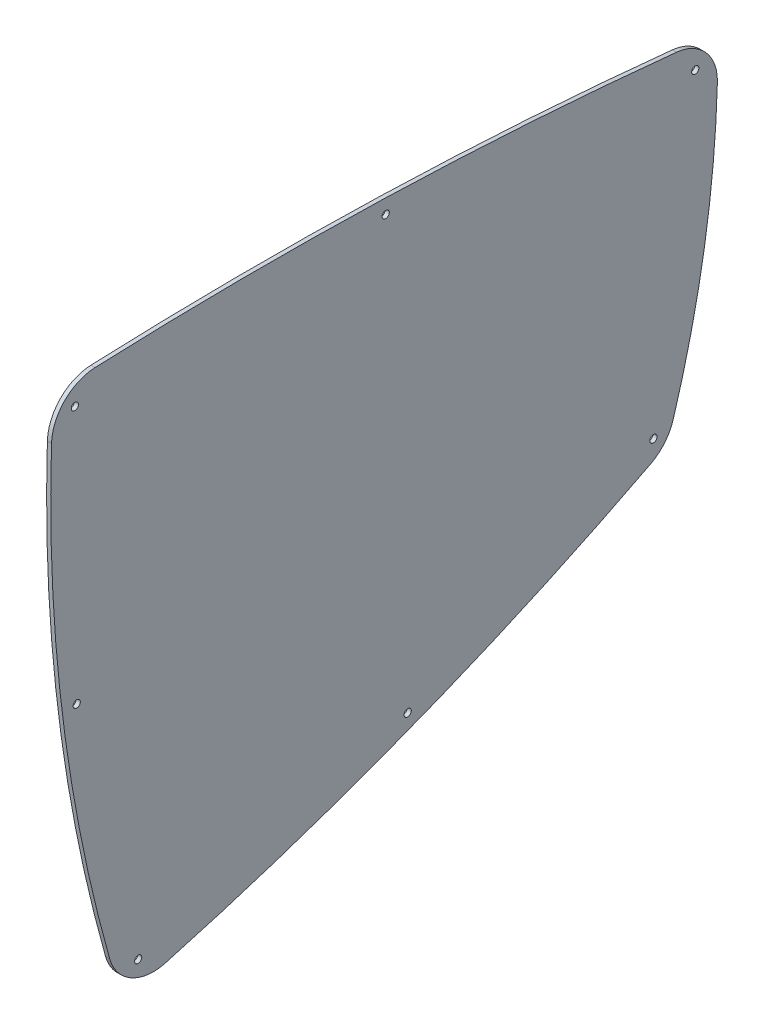
ISO-10303-21;
HEADER;
FILE_DESCRIPTION(('STEP AP214'),'2;1');
FILE_NAME('part.step','',(''),(''),'','','');
FILE_SCHEMA(('AUTOMOTIVE_DESIGN { 1 0 10303 214 1 1 1 1 }'));
ENDSEC;
DATA;
#1=APPLICATION_CONTEXT('core data for automotive mechanical design processes');
#2=APPLICATION_PROTOCOL_DEFINITION('international standard','automotive_design',2000,#1);
#3=PRODUCT_CONTEXT('',#1,'mechanical');
#4=PRODUCT('Part','Part','',(#3));
#5=PRODUCT_RELATED_PRODUCT_CATEGORY('part','',(#4));
#6=PRODUCT_DEFINITION_FORMATION('','',#4);
#7=PRODUCT_DEFINITION_CONTEXT('part definition',#1,'design');
#8=PRODUCT_DEFINITION('design','',#6,#7);
#9=PRODUCT_DEFINITION_SHAPE('','',#8);
#10=(LENGTH_UNIT() NAMED_UNIT(*) SI_UNIT(.MILLI.,.METRE.));
#11=(NAMED_UNIT(*) PLANE_ANGLE_UNIT() SI_UNIT($,.RADIAN.));
#12=(NAMED_UNIT(*) SI_UNIT($,.STERADIAN.) SOLID_ANGLE_UNIT());
#13=UNCERTAINTY_MEASURE_WITH_UNIT(LENGTH_MEASURE(1.E-05),#10,'distance_accuracy_value','');
#14=(GEOMETRIC_REPRESENTATION_CONTEXT(3) GLOBAL_UNCERTAINTY_ASSIGNED_CONTEXT((#13)) GLOBAL_UNIT_ASSIGNED_CONTEXT((#10,
#11,#12)) REPRESENTATION_CONTEXT('',''));
#15=CARTESIAN_POINT('',(0.,0.,0.));
#16=DIRECTION('',(0.,0.,1.));
#17=DIRECTION('',(1.,0.,0.));
#18=AXIS2_PLACEMENT_3D('',#15,#16,#17);
#19=CARTESIAN_POINT('',(2.,273.217482293825,342.316267833142));
#20=DIRECTION('',(1.,0.,0.));
#21=DIRECTION('',(0.,0.,-1.));
#22=AXIS2_PLACEMENT_3D('',#19,#20,#21);
#23=PLANE('',#22);
#24=CARTESIAN_POINT('',(2.,139.220684034103,225.256716860669));
#25=DIRECTION('',(1.,0.,0.));
#26=DIRECTION('',(0.,0.,-1.));
#27=AXIS2_PLACEMENT_3D('',#24,#25,#26);
#28=CIRCLE('',#27,1.75000000000001);
#29=CARTESIAN_POINT('',(2.,139.220684034103,223.506716860669));
#30=VERTEX_POINT('',#29);
#31=EDGE_CURVE('E205',#30,#30,#28,.T.);
#32=ORIENTED_EDGE('',*,*,#31,.F.);
#33=EDGE_LOOP('',(#32));
#34=FACE_BOUND('',#33,.T.);
#35=CARTESIAN_POINT('',(2.,223.135826185893,385.639096494495));
#36=DIRECTION('',(1.,0.,0.));
#37=DIRECTION('',(0.,0.,-1.));
#38=AXIS2_PLACEMENT_3D('',#35,#36,#37);
#39=CIRCLE('',#38,1.74999999999998);
#40=CARTESIAN_POINT('',(2.,223.135826185893,383.889096494495));
#41=VERTEX_POINT('',#40);
#42=EDGE_CURVE('E193',#41,#41,#39,.T.);
#43=ORIENTED_EDGE('',*,*,#42,.F.);
#44=EDGE_LOOP('',(#43));
#45=FACE_BOUND('',#44,.T.);
#46=CARTESIAN_POINT('',(2.,353.678197297446,235.905337517262));
#47=DIRECTION('',(1.,0.,0.));
#48=DIRECTION('',(0.,0.,-1.));
#49=AXIS2_PLACEMENT_3D('',#46,#47,#48);
#50=CIRCLE('',#49,1.75000000000001);
#51=CARTESIAN_POINT('',(2.,353.678197297446,234.155337517262));
#52=VERTEX_POINT('',#51);
#53=EDGE_CURVE('E181',#52,#52,#50,.T.);
#54=ORIENTED_EDGE('',*,*,#53,.F.);
#55=EDGE_LOOP('',(#54));
#56=FACE_BOUND('',#55,.T.);
#57=CARTESIAN_POINT('',(2.,204.306493550231,117.647009521328));
#58=DIRECTION('',(1.,0.,0.));
#59=DIRECTION('',(0.,0.,-1.));
#60=AXIS2_PLACEMENT_3D('',#57,#58,#59);
#61=CIRCLE('',#60,22.0000000000002);
#62=CARTESIAN_POINT('',(2.,184.759494234852,107.551722612846));
#63=VERTEX_POINT('',#62);
#64=CARTESIAN_POINT('',(2.,197.85525205083,96.6141427857546));
#65=VERTEX_POINT('',#64);
#66=EDGE_CURVE('E144',#63,#65,#61,.T.);
#67=ORIENTED_EDGE('',*,*,#66,.T.);
#68=CARTESIAN_POINT('',(2.,342.128471037418,566.985526144955));
#69=DIRECTION('',(1.,0.,0.));
#70=DIRECTION('',(0.,0.,-1.));
#71=AXIS2_PLACEMENT_3D('',#68,#69,#70);
#72=CIRCLE('',#71,492.);
#73=CARTESIAN_POINT('',(2.,328.820751392566,75.1655340768672));
#74=VERTEX_POINT('',#73);
#75=EDGE_CURVE('E92',#65,#74,#72,.T.);
#76=ORIENTED_EDGE('',*,*,#75,.T.);
#77=CARTESIAN_POINT('',(2.,329.415812027092,97.1574849417002));
#78=DIRECTION('',(1.,0.,0.));
#79=DIRECTION('',(0.,0.,-1.));
#80=AXIS2_PLACEMENT_3D('',#77,#78,#79);
#81=CIRCLE('',#80,21.9999999999999);
#82=CARTESIAN_POINT('',(2.,351.300094685774,94.904004851952));
#83=VERTEX_POINT('',#82);
#84=EDGE_CURVE('E159',#74,#83,#81,.T.);
#85=ORIENTED_EDGE('',*,*,#84,.T.);
#86=CARTESIAN_POINT('',(2.,-1592.02420540523,295.013036821593));
#87=DIRECTION('',(1.,0.,0.));
#88=DIRECTION('',(0.,0.,-1.));
#89=AXIS2_PLACEMENT_3D('',#86,#87,#88);
#90=CIRCLE('',#89,1953.6);
#91=CARTESIAN_POINT('',(2.,359.863425139158,376.791015078791));
#92=VERTEX_POINT('',#91);
#93=EDGE_CURVE('E172',#83,#92,#90,.T.);
#94=ORIENTED_EDGE('',*,*,#93,.T.);
#95=CARTESIAN_POINT('',(2.,337.882708578973,375.870091900219));
#96=DIRECTION('',(1.,0.,0.));
#97=DIRECTION('',(0.,0.,-1.));
#98=AXIS2_PLACEMENT_3D('',#95,#96,#97);
#99=CIRCLE('',#98,22.0000000000002);
#100=CARTESIAN_POINT('',(2.,338.567792846633,397.859422484532));
#101=VERTEX_POINT('',#100);
#102=EDGE_CURVE('E111',#92,#101,#99,.T.);
#103=ORIENTED_EDGE('',*,*,#102,.T.);
#104=CARTESIAN_POINT('',(2.,314.838965030397,-363.771027753947));
#105=DIRECTION('',(1.,0.,0.));
#106=DIRECTION('',(0.,0.,-1.));
#107=AXIS2_PLACEMENT_3D('',#104,#105,#106);
#108=CIRCLE('',#107,762.);
#109=CARTESIAN_POINT('',(2.,108.163139426056,369.665474685606));
#110=VERTEX_POINT('',#109);
#111=EDGE_CURVE('E105',#101,#110,#108,.T.);
#112=ORIENTED_EDGE('',*,*,#111,.T.);
#113=CARTESIAN_POINT('',(2.,114.130158013057,348.490142594175));
#114=DIRECTION('',(1.,0.,0.));
#115=DIRECTION('',(0.,0.,-1.));
#116=AXIS2_PLACEMENT_3D('',#113,#114,#115);
#117=CIRCLE('',#116,22.0000000000001);
#118=CARTESIAN_POINT('',(2.,92.9160331667392,342.662543860148));
#119=VERTEX_POINT('',#118);
#120=EDGE_CURVE('E109',#110,#119,#117,.T.);
#121=ORIENTED_EDGE('',*,*,#120,.T.);
#122=CARTESIAN_POINT('',(2.,1261.62145651844,663.710255934716));
#123=DIRECTION('',(1.,0.,0.));
#124=DIRECTION('',(0.,0.,-1.));
#125=AXIS2_PLACEMENT_3D('',#122,#123,#124);
#126=CIRCLE('',#125,1212.);
#127=EDGE_CURVE('E49',#119,#63,#126,.T.);
#128=ORIENTED_EDGE('',*,*,#127,.T.);
#129=EDGE_LOOP('',(#67,#76,#85,#94,#103,#112,#121,#128));
#130=FACE_BOUND('',#129,.T.);
#131=CARTESIAN_POINT('',(2.,339.312974250287,85.8860085553631));
#132=DIRECTION('',(1.,0.,0.));
#133=DIRECTION('',(0.,0.,-1.));
#134=AXIS2_PLACEMENT_3D('',#131,#132,#133);
#135=CIRCLE('',#134,1.75);
#136=CARTESIAN_POINT('',(2.,339.312974250287,84.1360085553631));
#137=VERTEX_POINT('',#136);
#138=EDGE_CURVE('E133',#137,#137,#135,.T.);
#139=ORIENTED_EDGE('',*,*,#138,.F.);
#140=EDGE_LOOP('',(#139));
#141=FACE_BOUND('',#140,.T.);
#142=CARTESIAN_POINT('',(2.,348.432268700157,386.533430085305));
#143=DIRECTION('',(1.,0.,0.));
#144=DIRECTION('',(0.,0.,-1.));
#145=AXIS2_PLACEMENT_3D('',#142,#143,#144);
#146=CIRCLE('',#145,1.74999999999998);
#147=CARTESIAN_POINT('',(2.,348.432268700157,384.783430085305));
#148=VERTEX_POINT('',#147);
#149=EDGE_CURVE('E187',#148,#148,#146,.T.);
#150=ORIENTED_EDGE('',*,*,#149,.F.);
#151=EDGE_LOOP('',(#150));
#152=FACE_BOUND('',#151,.T.);
#153=CARTESIAN_POINT('',(2.,101.068521567461,355.865347904068));
#154=DIRECTION('',(1.,0.,0.));
#155=DIRECTION('',(0.,0.,-1.));
#156=AXIS2_PLACEMENT_3D('',#153,#154,#155);
#157=CIRCLE('',#156,1.74999999999998);
#158=CARTESIAN_POINT('',(2.,101.068521567461,354.115347904068));
#159=VERTEX_POINT('',#158);
#160=EDGE_CURVE('E199',#159,#159,#157,.T.);
#161=ORIENTED_EDGE('',*,*,#160,.F.);
#162=EDGE_LOOP('',(#161));
#163=FACE_BOUND('',#162,.T.);
#164=CARTESIAN_POINT('',(2.,194.691048979365,106.13426763659));
#165=DIRECTION('',(1.,0.,0.));
#166=DIRECTION('',(0.,0.,-1.));
#167=AXIS2_PLACEMENT_3D('',#164,#165,#166);
#168=CIRCLE('',#167,1.75);
#169=CARTESIAN_POINT('',(2.,194.691048979365,104.38426763659));
#170=VERTEX_POINT('',#169);
#171=EDGE_CURVE('E211',#170,#170,#168,.T.);
#172=ORIENTED_EDGE('',*,*,#171,.F.);
#173=EDGE_LOOP('',(#172));
#174=FACE_BOUND('',#173,.T.);
#175=ADVANCED_FACE('F32',(#34,#45,#56,#130,#141,#152,#163,#174),#23,.T.);
#176=CARTESIAN_POINT('',(0.,273.217482293825,342.316267833142));
#177=DIRECTION('',(1.,0.,0.));
#178=DIRECTION('',(0.,0.,-1.));
#179=AXIS2_PLACEMENT_3D('',#176,#177,#178);
#180=PLANE('',#179);
#181=CARTESIAN_POINT('',(0.,139.220684034103,225.256716860669));
#182=DIRECTION('',(1.,0.,0.));
#183=DIRECTION('',(0.,0.,-1.));
#184=AXIS2_PLACEMENT_3D('',#181,#182,#183);
#185=CIRCLE('',#184,1.75000000000001);
#186=CARTESIAN_POINT('',(0.,139.220684034103,223.506716860669));
#187=VERTEX_POINT('',#186);
#188=EDGE_CURVE('E208',#187,#187,#185,.T.);
#189=ORIENTED_EDGE('',*,*,#188,.T.);
#190=EDGE_LOOP('',(#189));
#191=FACE_BOUND('',#190,.T.);
#192=CARTESIAN_POINT('',(0.,223.135826185893,385.639096494495));
#193=DIRECTION('',(1.,0.,0.));
#194=DIRECTION('',(0.,0.,-1.));
#195=AXIS2_PLACEMENT_3D('',#192,#193,#194);
#196=CIRCLE('',#195,1.74999999999998);
#197=CARTESIAN_POINT('',(0.,223.135826185893,383.889096494495));
#198=VERTEX_POINT('',#197);
#199=EDGE_CURVE('E196',#198,#198,#196,.T.);
#200=ORIENTED_EDGE('',*,*,#199,.T.);
#201=EDGE_LOOP('',(#200));
#202=FACE_BOUND('',#201,.T.);
#203=CARTESIAN_POINT('',(0.,353.678197297446,235.905337517262));
#204=DIRECTION('',(1.,0.,0.));
#205=DIRECTION('',(0.,0.,-1.));
#206=AXIS2_PLACEMENT_3D('',#203,#204,#205);
#207=CIRCLE('',#206,1.75000000000001);
#208=CARTESIAN_POINT('',(0.,353.678197297446,234.155337517262));
#209=VERTEX_POINT('',#208);
#210=EDGE_CURVE('E184',#209,#209,#207,.T.);
#211=ORIENTED_EDGE('',*,*,#210,.T.);
#212=EDGE_LOOP('',(#211));
#213=FACE_BOUND('',#212,.T.);
#214=CARTESIAN_POINT('',(0.,204.306493550231,117.647009521328));
#215=DIRECTION('',(1.,0.,0.));
#216=DIRECTION('',(0.,0.,-1.));
#217=AXIS2_PLACEMENT_3D('',#214,#215,#216);
#218=CIRCLE('',#217,22.0000000000002);
#219=CARTESIAN_POINT('',(0.,184.759494234852,107.551722612846));
#220=VERTEX_POINT('',#219);
#221=CARTESIAN_POINT('',(0.,197.85525205083,96.6141427857546));
#222=VERTEX_POINT('',#221);
#223=EDGE_CURVE('E129',#220,#222,#218,.T.);
#224=ORIENTED_EDGE('',*,*,#223,.F.);
#225=CARTESIAN_POINT('',(0.,1261.62145651844,663.710255934716));
#226=DIRECTION('',(1.,0.,0.));
#227=DIRECTION('',(0.,0.,-1.));
#228=AXIS2_PLACEMENT_3D('',#225,#226,#227);
#229=CIRCLE('',#228,1212.);
#230=CARTESIAN_POINT('',(0.,92.9160331667392,342.662543860148));
#231=VERTEX_POINT('',#230);
#232=EDGE_CURVE('E84',#231,#220,#229,.T.);
#233=ORIENTED_EDGE('',*,*,#232,.F.);
#234=CARTESIAN_POINT('',(0.,114.130158013057,348.490142594175));
#235=DIRECTION('',(1.,0.,0.));
#236=DIRECTION('',(0.,0.,-1.));
#237=AXIS2_PLACEMENT_3D('',#234,#235,#236);
#238=CIRCLE('',#237,22.0000000000001);
#239=CARTESIAN_POINT('',(0.,108.163139426056,369.665474685606));
#240=VERTEX_POINT('',#239);
#241=EDGE_CURVE('E78',#240,#231,#238,.T.);
#242=ORIENTED_EDGE('',*,*,#241,.F.);
#243=CARTESIAN_POINT('',(0.,314.838965030397,-363.771027753947));
#244=DIRECTION('',(1.,0.,0.));
#245=DIRECTION('',(0.,0.,-1.));
#246=AXIS2_PLACEMENT_3D('',#243,#244,#245);
#247=CIRCLE('',#246,762.);
#248=CARTESIAN_POINT('',(0.,338.567792846633,397.859422484532));
#249=VERTEX_POINT('',#248);
#250=EDGE_CURVE('E119',#249,#240,#247,.T.);
#251=ORIENTED_EDGE('',*,*,#250,.F.);
#252=CARTESIAN_POINT('',(0.,337.882708578973,375.870091900219));
#253=DIRECTION('',(1.,0.,0.));
#254=DIRECTION('',(0.,0.,-1.));
#255=AXIS2_PLACEMENT_3D('',#252,#253,#254);
#256=CIRCLE('',#255,22.0000000000002);
#257=CARTESIAN_POINT('',(0.,359.863425139158,376.791015078791));
#258=VERTEX_POINT('',#257);
#259=EDGE_CURVE('E139',#258,#249,#256,.T.);
#260=ORIENTED_EDGE('',*,*,#259,.F.);
#261=CARTESIAN_POINT('',(0.,-1592.02420540523,295.013036821593));
#262=DIRECTION('',(1.,0.,0.));
#263=DIRECTION('',(0.,0.,-1.));
#264=AXIS2_PLACEMENT_3D('',#261,#262,#263);
#265=CIRCLE('',#264,1953.6);
#266=CARTESIAN_POINT('',(0.,351.300094685774,94.904004851952));
#267=VERTEX_POINT('',#266);
#268=EDGE_CURVE('E137',#267,#258,#265,.T.);
#269=ORIENTED_EDGE('',*,*,#268,.F.);
#270=CARTESIAN_POINT('',(0.,329.415812027092,97.1574849417002));
#271=DIRECTION('',(1.,0.,0.));
#272=DIRECTION('',(0.,0.,-1.));
#273=AXIS2_PLACEMENT_3D('',#270,#271,#272);
#274=CIRCLE('',#273,21.9999999999999);
#275=CARTESIAN_POINT('',(0.,328.820751392566,75.1655340768672));
#276=VERTEX_POINT('',#275);
#277=EDGE_CURVE('E135',#276,#267,#274,.T.);
#278=ORIENTED_EDGE('',*,*,#277,.F.);
#279=CARTESIAN_POINT('',(0.,342.128471037418,566.985526144955));
#280=DIRECTION('',(1.,0.,0.));
#281=DIRECTION('',(0.,0.,-1.));
#282=AXIS2_PLACEMENT_3D('',#279,#280,#281);
#283=CIRCLE('',#282,492.);
#284=EDGE_CURVE('E132',#222,#276,#283,.T.);
#285=ORIENTED_EDGE('',*,*,#284,.F.);
#286=EDGE_LOOP('',(#224,#233,#242,#251,#260,#269,#278,#285));
#287=FACE_BOUND('',#286,.T.);
#288=CARTESIAN_POINT('',(0.,339.312974250287,85.8860085553631));
#289=DIRECTION('',(1.,0.,0.));
#290=DIRECTION('',(0.,0.,-1.));
#291=AXIS2_PLACEMENT_3D('',#288,#289,#290);
#292=CIRCLE('',#291,1.75);
#293=CARTESIAN_POINT('',(0.,339.312974250287,84.1360085553631));
#294=VERTEX_POINT('',#293);
#295=EDGE_CURVE('E178',#294,#294,#292,.T.);
#296=ORIENTED_EDGE('',*,*,#295,.T.);
#297=EDGE_LOOP('',(#296));
#298=FACE_BOUND('',#297,.T.);
#299=CARTESIAN_POINT('',(0.,348.432268700157,386.533430085305));
#300=DIRECTION('',(1.,0.,0.));
#301=DIRECTION('',(0.,0.,-1.));
#302=AXIS2_PLACEMENT_3D('',#299,#300,#301);
#303=CIRCLE('',#302,1.74999999999998);
#304=CARTESIAN_POINT('',(0.,348.432268700157,384.783430085305));
#305=VERTEX_POINT('',#304);
#306=EDGE_CURVE('E190',#305,#305,#303,.T.);
#307=ORIENTED_EDGE('',*,*,#306,.T.);
#308=EDGE_LOOP('',(#307));
#309=FACE_BOUND('',#308,.T.);
#310=CARTESIAN_POINT('',(0.,101.068521567461,355.865347904068));
#311=DIRECTION('',(1.,0.,0.));
#312=DIRECTION('',(0.,0.,-1.));
#313=AXIS2_PLACEMENT_3D('',#310,#311,#312);
#314=CIRCLE('',#313,1.74999999999998);
#315=CARTESIAN_POINT('',(0.,101.068521567461,354.115347904068));
#316=VERTEX_POINT('',#315);
#317=EDGE_CURVE('E202',#316,#316,#314,.T.);
#318=ORIENTED_EDGE('',*,*,#317,.T.);
#319=EDGE_LOOP('',(#318));
#320=FACE_BOUND('',#319,.T.);
#321=CARTESIAN_POINT('',(0.,194.691048979365,106.13426763659));
#322=DIRECTION('',(1.,0.,0.));
#323=DIRECTION('',(0.,0.,-1.));
#324=AXIS2_PLACEMENT_3D('',#321,#322,#323);
#325=CIRCLE('',#324,1.75);
#326=CARTESIAN_POINT('',(0.,194.691048979365,104.38426763659));
#327=VERTEX_POINT('',#326);
#328=EDGE_CURVE('E214',#327,#327,#325,.T.);
#329=ORIENTED_EDGE('',*,*,#328,.T.);
#330=EDGE_LOOP('',(#329));
#331=FACE_BOUND('',#330,.T.);
#332=ADVANCED_FACE('F163',(#191,#202,#213,#287,#298,#309,#320,#331),#180,.F.);
#333=CARTESIAN_POINT('',(2.,204.306493550231,117.647009521328));
#334=DIRECTION('',(-1.,0.,0.));
#335=DIRECTION('',(0.,0.,1.));
#336=AXIS2_PLACEMENT_3D('',#333,#334,#335);
#337=CYLINDRICAL_SURFACE('',#336,22.0000000000002);
#338=ORIENTED_EDGE('',*,*,#223,.T.);
#339=DIRECTION('',(-1.,0.,0.));
#340=VECTOR('',#339,1.);
#341=CARTESIAN_POINT('',(2.,197.85525205083,96.6141427857546));
#342=LINE('',#341,#340);
#343=EDGE_CURVE('E11',#65,#222,#342,.T.);
#344=ORIENTED_EDGE('',*,*,#343,.F.);
#345=ORIENTED_EDGE('',*,*,#66,.F.);
#346=DIRECTION('',(-1.,0.,0.));
#347=VECTOR('',#346,1.);
#348=CARTESIAN_POINT('',(2.,184.759494234852,107.551722612846));
#349=LINE('',#348,#347);
#350=EDGE_CURVE('E125',#63,#220,#349,.T.);
#351=ORIENTED_EDGE('',*,*,#350,.T.);
#352=EDGE_LOOP('',(#338,#344,#345,#351));
#353=FACE_BOUND('',#352,.T.);
#354=ADVANCED_FACE('F34',(#353),#337,.T.);
#355=CARTESIAN_POINT('',(2.,342.128471037418,566.985526144955));
#356=DIRECTION('',(-1.,0.,0.));
#357=DIRECTION('',(0.,0.,1.));
#358=AXIS2_PLACEMENT_3D('',#355,#356,#357);
#359=CYLINDRICAL_SURFACE('',#358,492.);
#360=ORIENTED_EDGE('',*,*,#284,.T.);
#361=DIRECTION('',(-1.,0.,0.));
#362=VECTOR('',#361,1.);
#363=CARTESIAN_POINT('',(2.,328.820751392566,75.1655340768672));
#364=LINE('',#363,#362);
#365=EDGE_CURVE('E41',#74,#276,#364,.T.);
#366=ORIENTED_EDGE('',*,*,#365,.F.);
#367=ORIENTED_EDGE('',*,*,#75,.F.);
#368=ORIENTED_EDGE('',*,*,#343,.T.);
#369=EDGE_LOOP('',(#360,#366,#367,#368));
#370=FACE_BOUND('',#369,.T.);
#371=ADVANCED_FACE('F249',(#370),#359,.T.);
#372=CARTESIAN_POINT('',(2.,329.415812027092,97.1574849417002));
#373=DIRECTION('',(-1.,0.,0.));
#374=DIRECTION('',(0.,0.,1.));
#375=AXIS2_PLACEMENT_3D('',#372,#373,#374);
#376=CYLINDRICAL_SURFACE('',#375,21.9999999999999);
#377=ORIENTED_EDGE('',*,*,#277,.T.);
#378=DIRECTION('',(-1.,0.,0.));
#379=VECTOR('',#378,1.);
#380=CARTESIAN_POINT('',(2.,351.300094685774,94.904004851952));
#381=LINE('',#380,#379);
#382=EDGE_CURVE('E151',#83,#267,#381,.T.);
#383=ORIENTED_EDGE('',*,*,#382,.F.);
#384=ORIENTED_EDGE('',*,*,#84,.F.);
#385=ORIENTED_EDGE('',*,*,#365,.T.);
#386=EDGE_LOOP('',(#377,#383,#384,#385));
#387=FACE_BOUND('',#386,.T.);
#388=ADVANCED_FACE('F157',(#387),#376,.T.);
#389=CARTESIAN_POINT('',(2.,-1592.02420540523,295.013036821593));
#390=DIRECTION('',(-1.,0.,0.));
#391=DIRECTION('',(0.,0.,1.));
#392=AXIS2_PLACEMENT_3D('',#389,#390,#391);
#393=CYLINDRICAL_SURFACE('',#392,1953.6);
#394=ORIENTED_EDGE('',*,*,#268,.T.);
#395=DIRECTION('',(-1.,0.,0.));
#396=VECTOR('',#395,1.);
#397=CARTESIAN_POINT('',(2.,359.863425139158,376.791015078791));
#398=LINE('',#397,#396);
#399=EDGE_CURVE('E148',#92,#258,#398,.T.);
#400=ORIENTED_EDGE('',*,*,#399,.F.);
#401=ORIENTED_EDGE('',*,*,#93,.F.);
#402=ORIENTED_EDGE('',*,*,#382,.T.);
#403=EDGE_LOOP('',(#394,#400,#401,#402));
#404=FACE_BOUND('',#403,.T.);
#405=ADVANCED_FACE('F168',(#404),#393,.T.);
#406=CARTESIAN_POINT('',(2.,337.882708578973,375.870091900219));
#407=DIRECTION('',(-1.,0.,0.));
#408=DIRECTION('',(0.,0.,1.));
#409=AXIS2_PLACEMENT_3D('',#406,#407,#408);
#410=CYLINDRICAL_SURFACE('',#409,22.0000000000002);
#411=ORIENTED_EDGE('',*,*,#259,.T.);
#412=DIRECTION('',(-1.,0.,0.));
#413=VECTOR('',#412,1.);
#414=CARTESIAN_POINT('',(2.,338.567792846633,397.859422484532));
#415=LINE('',#414,#413);
#416=EDGE_CURVE('E120',#101,#249,#415,.T.);
#417=ORIENTED_EDGE('',*,*,#416,.F.);
#418=ORIENTED_EDGE('',*,*,#102,.F.);
#419=ORIENTED_EDGE('',*,*,#399,.T.);
#420=EDGE_LOOP('',(#411,#417,#418,#419));
#421=FACE_BOUND('',#420,.T.);
#422=ADVANCED_FACE('F171',(#421),#410,.T.);
#423=CARTESIAN_POINT('',(2.,314.838965030397,-363.771027753947));
#424=DIRECTION('',(-1.,0.,0.));
#425=DIRECTION('',(0.,0.,1.));
#426=AXIS2_PLACEMENT_3D('',#423,#424,#425);
#427=CYLINDRICAL_SURFACE('',#426,762.);
#428=ORIENTED_EDGE('',*,*,#250,.T.);
#429=DIRECTION('',(-1.,0.,0.));
#430=VECTOR('',#429,1.);
#431=CARTESIAN_POINT('',(2.,108.163139426056,369.665474685606));
#432=LINE('',#431,#430);
#433=EDGE_CURVE('E116',#110,#240,#432,.T.);
#434=ORIENTED_EDGE('',*,*,#433,.F.);
#435=ORIENTED_EDGE('',*,*,#111,.F.);
#436=ORIENTED_EDGE('',*,*,#416,.T.);
#437=EDGE_LOOP('',(#428,#434,#435,#436));
#438=FACE_BOUND('',#437,.T.);
#439=ADVANCED_FACE('F117',(#438),#427,.T.);
#440=CARTESIAN_POINT('',(2.,114.130158013057,348.490142594175));
#441=DIRECTION('',(-1.,0.,0.));
#442=DIRECTION('',(0.,0.,1.));
#443=AXIS2_PLACEMENT_3D('',#440,#441,#442);
#444=CYLINDRICAL_SURFACE('',#443,22.0000000000001);
#445=ORIENTED_EDGE('',*,*,#241,.T.);
#446=DIRECTION('',(-1.,0.,0.));
#447=VECTOR('',#446,1.);
#448=CARTESIAN_POINT('',(2.,92.9160331667392,342.662543860148));
#449=LINE('',#448,#447);
#450=EDGE_CURVE('E121',#119,#231,#449,.T.);
#451=ORIENTED_EDGE('',*,*,#450,.F.);
#452=ORIENTED_EDGE('',*,*,#120,.F.);
#453=ORIENTED_EDGE('',*,*,#433,.T.);
#454=EDGE_LOOP('',(#445,#451,#452,#453));
#455=FACE_BOUND('',#454,.T.);
#456=ADVANCED_FACE('F123',(#455),#444,.T.);
#457=CARTESIAN_POINT('',(2.,1261.62145651844,663.710255934716));
#458=DIRECTION('',(-1.,0.,0.));
#459=DIRECTION('',(0.,0.,1.));
#460=AXIS2_PLACEMENT_3D('',#457,#458,#459);
#461=CYLINDRICAL_SURFACE('',#460,1212.);
#462=ORIENTED_EDGE('',*,*,#232,.T.);
#463=ORIENTED_EDGE('',*,*,#350,.F.);
#464=ORIENTED_EDGE('',*,*,#127,.F.);
#465=ORIENTED_EDGE('',*,*,#450,.T.);
#466=EDGE_LOOP('',(#462,#463,#464,#465));
#467=FACE_BOUND('',#466,.T.);
#468=ADVANCED_FACE('F237',(#467),#461,.T.);
#469=CARTESIAN_POINT('',(2.,339.312974250287,85.8860085553631));
#470=DIRECTION('',(-1.,0.,0.));
#471=DIRECTION('',(0.,0.,1.));
#472=AXIS2_PLACEMENT_3D('',#469,#470,#471);
#473=CYLINDRICAL_SURFACE('',#472,1.75);
#474=ORIENTED_EDGE('',*,*,#138,.T.);
#475=EDGE_LOOP('',(#474));
#476=FACE_BOUND('',#475,.T.);
#477=ORIENTED_EDGE('',*,*,#295,.F.);
#478=EDGE_LOOP('',(#477));
#479=FACE_BOUND('',#478,.T.);
#480=ADVANCED_FACE('F234',(#476,#479),#473,.F.);
#481=CARTESIAN_POINT('',(2.,353.678197297446,235.905337517262));
#482=DIRECTION('',(-1.,0.,0.));
#483=DIRECTION('',(0.,0.,1.));
#484=AXIS2_PLACEMENT_3D('',#481,#482,#483);
#485=CYLINDRICAL_SURFACE('',#484,1.75000000000001);
#486=ORIENTED_EDGE('',*,*,#53,.T.);
#487=EDGE_LOOP('',(#486));
#488=FACE_BOUND('',#487,.T.);
#489=ORIENTED_EDGE('',*,*,#210,.F.);
#490=EDGE_LOOP('',(#489));
#491=FACE_BOUND('',#490,.T.);
#492=ADVANCED_FACE('F313',(#488,#491),#485,.F.);
#493=CARTESIAN_POINT('',(2.,348.432268700157,386.533430085305));
#494=DIRECTION('',(-1.,0.,0.));
#495=DIRECTION('',(0.,0.,1.));
#496=AXIS2_PLACEMENT_3D('',#493,#494,#495);
#497=CYLINDRICAL_SURFACE('',#496,1.74999999999998);
#498=ORIENTED_EDGE('',*,*,#149,.T.);
#499=EDGE_LOOP('',(#498));
#500=FACE_BOUND('',#499,.T.);
#501=ORIENTED_EDGE('',*,*,#306,.F.);
#502=EDGE_LOOP('',(#501));
#503=FACE_BOUND('',#502,.T.);
#504=ADVANCED_FACE('F321',(#500,#503),#497,.F.);
#505=CARTESIAN_POINT('',(2.,223.135826185893,385.639096494495));
#506=DIRECTION('',(-1.,0.,0.));
#507=DIRECTION('',(0.,0.,1.));
#508=AXIS2_PLACEMENT_3D('',#505,#506,#507);
#509=CYLINDRICAL_SURFACE('',#508,1.74999999999998);
#510=ORIENTED_EDGE('',*,*,#42,.T.);
#511=EDGE_LOOP('',(#510));
#512=FACE_BOUND('',#511,.T.);
#513=ORIENTED_EDGE('',*,*,#199,.F.);
#514=EDGE_LOOP('',(#513));
#515=FACE_BOUND('',#514,.T.);
#516=ADVANCED_FACE('F329',(#512,#515),#509,.F.);
#517=CARTESIAN_POINT('',(2.,101.068521567461,355.865347904068));
#518=DIRECTION('',(-1.,0.,0.));
#519=DIRECTION('',(0.,0.,1.));
#520=AXIS2_PLACEMENT_3D('',#517,#518,#519);
#521=CYLINDRICAL_SURFACE('',#520,1.74999999999998);
#522=ORIENTED_EDGE('',*,*,#160,.T.);
#523=EDGE_LOOP('',(#522));
#524=FACE_BOUND('',#523,.T.);
#525=ORIENTED_EDGE('',*,*,#317,.F.);
#526=EDGE_LOOP('',(#525));
#527=FACE_BOUND('',#526,.T.);
#528=ADVANCED_FACE('F338',(#524,#527),#521,.F.);
#529=CARTESIAN_POINT('',(2.,139.220684034103,225.256716860669));
#530=DIRECTION('',(-1.,0.,0.));
#531=DIRECTION('',(0.,0.,1.));
#532=AXIS2_PLACEMENT_3D('',#529,#530,#531);
#533=CYLINDRICAL_SURFACE('',#532,1.75000000000001);
#534=ORIENTED_EDGE('',*,*,#31,.T.);
#535=EDGE_LOOP('',(#534));
#536=FACE_BOUND('',#535,.T.);
#537=ORIENTED_EDGE('',*,*,#188,.F.);
#538=EDGE_LOOP('',(#537));
#539=FACE_BOUND('',#538,.T.);
#540=ADVANCED_FACE('F347',(#536,#539),#533,.F.);
#541=CARTESIAN_POINT('',(2.,194.691048979365,106.13426763659));
#542=DIRECTION('',(-1.,0.,0.));
#543=DIRECTION('',(0.,0.,1.));
#544=AXIS2_PLACEMENT_3D('',#541,#542,#543);
#545=CYLINDRICAL_SURFACE('',#544,1.75);
#546=ORIENTED_EDGE('',*,*,#171,.T.);
#547=EDGE_LOOP('',(#546));
#548=FACE_BOUND('',#547,.T.);
#549=ORIENTED_EDGE('',*,*,#328,.F.);
#550=EDGE_LOOP('',(#549));
#551=FACE_BOUND('',#550,.T.);
#552=ADVANCED_FACE('F220',(#548,#551),#545,.F.);
#553=CLOSED_SHELL('',(#175,#332,#354,#371,#388,#405,#422,#439,#456,#468,#480,#492,#504,#516,
#528,#540,#552));
#554=MANIFOLD_SOLID_BREP('B2',#553);
#555=ADVANCED_BREP_SHAPE_REPRESENTATION('',(#18,#554),#14);
#556=SHAPE_DEFINITION_REPRESENTATION(#9,#555);
ENDSEC;
END-ISO-10303-21;
